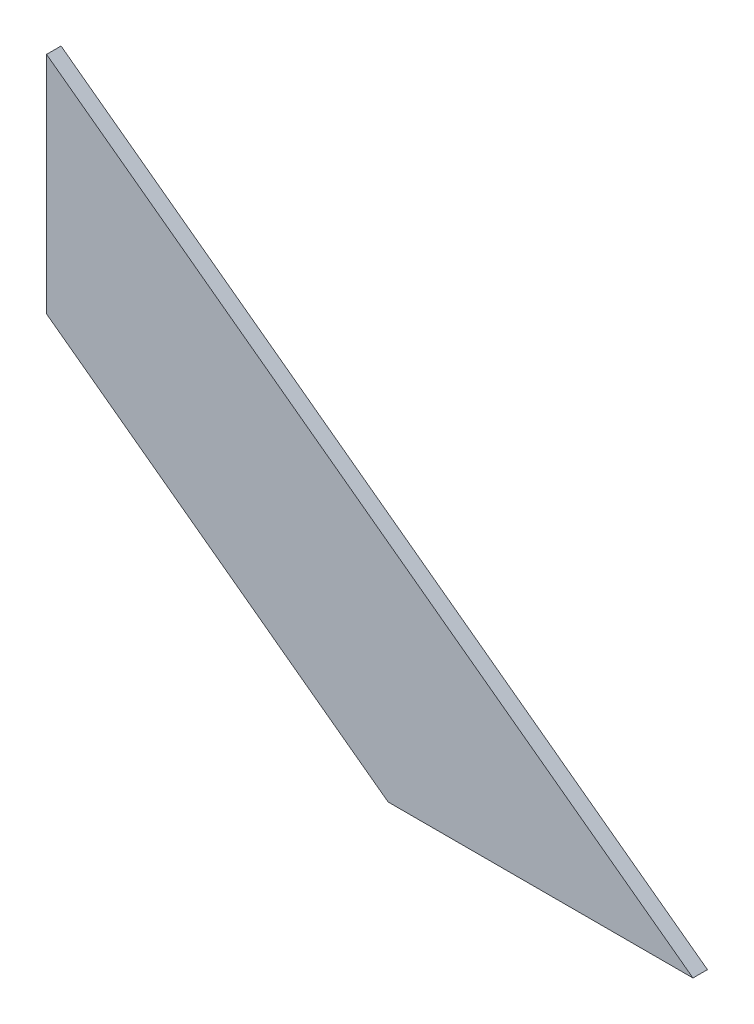
ISO-10303-21;
HEADER;
FILE_DESCRIPTION(('STEP AP214'),'2;1');
FILE_NAME('part.step','',(''),(''),'','','');
FILE_SCHEMA(('AUTOMOTIVE_DESIGN { 1 0 10303 214 1 1 1 1 }'));
ENDSEC;
DATA;
#1=APPLICATION_CONTEXT('core data for automotive mechanical design processes');
#2=APPLICATION_PROTOCOL_DEFINITION('international standard','automotive_design',2000,#1);
#3=PRODUCT_CONTEXT('',#1,'mechanical');
#4=PRODUCT('Part','Part','',(#3));
#5=PRODUCT_RELATED_PRODUCT_CATEGORY('part','',(#4));
#6=PRODUCT_DEFINITION_FORMATION('','',#4);
#7=PRODUCT_DEFINITION_CONTEXT('part definition',#1,'design');
#8=PRODUCT_DEFINITION('design','',#6,#7);
#9=PRODUCT_DEFINITION_SHAPE('','',#8);
#10=(LENGTH_UNIT() NAMED_UNIT(*) SI_UNIT(.MILLI.,.METRE.));
#11=(NAMED_UNIT(*) PLANE_ANGLE_UNIT() SI_UNIT($,.RADIAN.));
#12=(NAMED_UNIT(*) SI_UNIT($,.STERADIAN.) SOLID_ANGLE_UNIT());
#13=UNCERTAINTY_MEASURE_WITH_UNIT(LENGTH_MEASURE(1.E-05),#10,'distance_accuracy_value','');
#14=(GEOMETRIC_REPRESENTATION_CONTEXT(3) GLOBAL_UNCERTAINTY_ASSIGNED_CONTEXT((#13)) GLOBAL_UNIT_ASSIGNED_CONTEXT((#10,
#11,#12)) REPRESENTATION_CONTEXT('',''));
#15=CARTESIAN_POINT('',(0.,0.,0.));
#16=DIRECTION('',(0.,0.,1.));
#17=DIRECTION('',(1.,0.,0.));
#18=AXIS2_PLACEMENT_3D('',#15,#16,#17);
#19=CARTESIAN_POINT('',(-503.389866918467,-30.2616666212028,-1.524));
#20=DIRECTION('',(0.,1.,0.));
#21=DIRECTION('',(0.,0.,1.));
#22=AXIS2_PLACEMENT_3D('',#19,#20,#21);
#23=PLANE('',#22);
#24=DIRECTION('',(-1.,0.,0.));
#25=VECTOR('',#24,1.);
#26=CARTESIAN_POINT('',(-503.389866918467,-30.2616666212028,0.));
#27=LINE('',#26,#25);
#28=CARTESIAN_POINT('',(-471.292522592368,-30.2616666212028,0.));
#29=VERTEX_POINT('',#28);
#30=CARTESIAN_POINT('',(-503.389866918467,-30.2616666212028,0.));
#31=VERTEX_POINT('',#30);
#32=EDGE_CURVE('E96',#29,#31,#27,.T.);
#33=ORIENTED_EDGE('',*,*,#32,.T.);
#34=DIRECTION('',(0.,0.,1.));
#35=VECTOR('',#34,1.);
#36=CARTESIAN_POINT('',(-503.389866918467,-30.2616666212028,-1.524));
#37=LINE('',#36,#35);
#38=CARTESIAN_POINT('',(-503.389866918467,-30.2616666212028,-1.524));
#39=VERTEX_POINT('',#38);
#40=EDGE_CURVE('E11',#39,#31,#37,.T.);
#41=ORIENTED_EDGE('',*,*,#40,.F.);
#42=DIRECTION('',(-1.,0.,0.));
#43=VECTOR('',#42,1.);
#44=CARTESIAN_POINT('',(-503.389866918467,-30.2616666212028,-1.524));
#45=LINE('',#44,#43);
#46=CARTESIAN_POINT('',(-471.292522592368,-30.2616666212028,-1.524));
#47=VERTEX_POINT('',#46);
#48=EDGE_CURVE('E84',#47,#39,#45,.T.);
#49=ORIENTED_EDGE('',*,*,#48,.F.);
#50=DIRECTION('',(0.,0.,1.));
#51=VECTOR('',#50,1.);
#52=CARTESIAN_POINT('',(-471.292522592368,-30.2616666212028,-1.524));
#53=LINE('',#52,#51);
#54=EDGE_CURVE('E92',#47,#29,#53,.T.);
#55=ORIENTED_EDGE('',*,*,#54,.T.);
#56=EDGE_LOOP('',(#33,#41,#49,#55));
#57=FACE_BOUND('',#56,.T.);
#58=ADVANCED_FACE('F33',(#57),#23,.F.);
#59=CARTESIAN_POINT('',(-539.362495023416,-3.73427545755216,-1.524));
#60=DIRECTION('',(0.593507045519334,0.804828793544883,0.));
#61=DIRECTION('',(-0.804828793544883,0.593507045519334,0.));
#62=AXIS2_PLACEMENT_3D('',#59,#60,#61);
#63=PLANE('',#62);
#64=DIRECTION('',(-0.804828793544883,0.593507045519334,0.));
#65=VECTOR('',#64,1.);
#66=CARTESIAN_POINT('',(-539.362495023416,-3.73427545755216,0.));
#67=LINE('',#66,#65);
#68=CARTESIAN_POINT('',(-539.362495023416,-3.73427545755216,0.));
#69=VERTEX_POINT('',#68);
#70=EDGE_CURVE('E88',#31,#69,#67,.T.);
#71=ORIENTED_EDGE('',*,*,#70,.T.);
#72=DIRECTION('',(0.,0.,1.));
#73=VECTOR('',#72,1.);
#74=CARTESIAN_POINT('',(-539.362495023416,-3.73427545755216,-1.524));
#75=LINE('',#74,#73);
#76=CARTESIAN_POINT('',(-539.362495023416,-3.73427545755216,-1.524));
#77=VERTEX_POINT('',#76);
#78=EDGE_CURVE('E41',#77,#69,#75,.T.);
#79=ORIENTED_EDGE('',*,*,#78,.F.);
#80=DIRECTION('',(-0.804828793544883,0.593507045519334,0.));
#81=VECTOR('',#80,1.);
#82=CARTESIAN_POINT('',(-539.362495023416,-3.73427545755216,-1.524));
#83=LINE('',#82,#81);
#84=EDGE_CURVE('E79',#39,#77,#83,.T.);
#85=ORIENTED_EDGE('',*,*,#84,.F.);
#86=ORIENTED_EDGE('',*,*,#40,.T.);
#87=EDGE_LOOP('',(#71,#79,#85,#86));
#88=FACE_BOUND('',#87,.T.);
#89=ADVANCED_FACE('F87',(#88),#63,.F.);
#90=CARTESIAN_POINT('',(-539.362495023416,19.9353548449299,-1.524));
#91=DIRECTION('',(1.,0.,0.));
#92=DIRECTION('',(0.,0.,-1.));
#93=AXIS2_PLACEMENT_3D('',#90,#91,#92);
#94=PLANE('',#93);
#95=DIRECTION('',(0.,1.,0.));
#96=VECTOR('',#95,1.);
#97=CARTESIAN_POINT('',(-539.362495023416,19.9353548449299,0.));
#98=LINE('',#97,#96);
#99=CARTESIAN_POINT('',(-539.362495023416,19.9353548449299,0.));
#100=VERTEX_POINT('',#99);
#101=EDGE_CURVE('E66',#69,#100,#98,.T.);
#102=ORIENTED_EDGE('',*,*,#101,.T.);
#103=DIRECTION('',(0.,0.,1.));
#104=VECTOR('',#103,1.);
#105=CARTESIAN_POINT('',(-539.362495023416,19.9353548449299,-1.524));
#106=LINE('',#105,#104);
#107=CARTESIAN_POINT('',(-539.362495023416,19.9353548449299,-1.524));
#108=VERTEX_POINT('',#107);
#109=EDGE_CURVE('E89',#108,#100,#106,.T.);
#110=ORIENTED_EDGE('',*,*,#109,.F.);
#111=DIRECTION('',(0.,1.,0.));
#112=VECTOR('',#111,1.);
#113=CARTESIAN_POINT('',(-539.362495023416,19.9353548449299,-1.524));
#114=LINE('',#113,#112);
#115=EDGE_CURVE('E82',#77,#108,#114,.T.);
#116=ORIENTED_EDGE('',*,*,#115,.F.);
#117=ORIENTED_EDGE('',*,*,#78,.T.);
#118=EDGE_LOOP('',(#102,#110,#116,#117));
#119=FACE_BOUND('',#118,.T.);
#120=ADVANCED_FACE('F90',(#119),#94,.F.);
#121=CARTESIAN_POINT('',(-471.292522592368,-30.2616666212028,-1.524));
#122=DIRECTION('',(-0.593507045519334,-0.804828793544883,0.));
#123=DIRECTION('',(0.804828793544883,-0.593507045519334,0.));
#124=AXIS2_PLACEMENT_3D('',#121,#122,#123);
#125=PLANE('',#124);
#126=DIRECTION('',(0.804828793544883,-0.593507045519334,0.));
#127=VECTOR('',#126,1.);
#128=CARTESIAN_POINT('',(-471.292522592368,-30.2616666212028,0.));
#129=LINE('',#128,#127);
#130=EDGE_CURVE('E72',#100,#29,#129,.T.);
#131=ORIENTED_EDGE('',*,*,#130,.T.);
#132=ORIENTED_EDGE('',*,*,#54,.F.);
#133=DIRECTION('',(0.804828793544883,-0.593507045519334,0.));
#134=VECTOR('',#133,1.);
#135=CARTESIAN_POINT('',(-471.292522592368,-30.2616666212028,-1.524));
#136=LINE('',#135,#134);
#137=EDGE_CURVE('E49',#108,#47,#136,.T.);
#138=ORIENTED_EDGE('',*,*,#137,.F.);
#139=ORIENTED_EDGE('',*,*,#109,.T.);
#140=EDGE_LOOP('',(#131,#132,#138,#139));
#141=FACE_BOUND('',#140,.T.);
#142=ADVANCED_FACE('F103',(#141),#125,.F.);
#143=CARTESIAN_POINT('',(0.,0.,-1.524));
#144=DIRECTION('',(0.,0.,-1.));
#145=DIRECTION('',(-1.,0.,0.));
#146=AXIS2_PLACEMENT_3D('',#143,#144,#145);
#147=PLANE('',#146);
#148=ORIENTED_EDGE('',*,*,#48,.T.);
#149=ORIENTED_EDGE('',*,*,#84,.T.);
#150=ORIENTED_EDGE('',*,*,#115,.T.);
#151=ORIENTED_EDGE('',*,*,#137,.T.);
#152=EDGE_LOOP('',(#148,#149,#150,#151));
#153=FACE_BOUND('',#152,.T.);
#154=ADVANCED_FACE('F80',(#153),#147,.T.);
#155=CARTESIAN_POINT('',(0.,0.,0.));
#156=DIRECTION('',(0.,0.,-1.));
#157=DIRECTION('',(-1.,0.,0.));
#158=AXIS2_PLACEMENT_3D('',#155,#156,#157);
#159=PLANE('',#158);
#160=ORIENTED_EDGE('',*,*,#32,.F.);
#161=ORIENTED_EDGE('',*,*,#130,.F.);
#162=ORIENTED_EDGE('',*,*,#101,.F.);
#163=ORIENTED_EDGE('',*,*,#70,.F.);
#164=EDGE_LOOP('',(#160,#161,#162,#163));
#165=FACE_BOUND('',#164,.T.);
#166=ADVANCED_FACE('F106',(#165),#159,.F.);
#167=CLOSED_SHELL('',(#58,#89,#120,#142,#154,#166));
#168=MANIFOLD_SOLID_BREP('B2',#167);
#169=ADVANCED_BREP_SHAPE_REPRESENTATION('',(#18,#168),#14);
#170=SHAPE_DEFINITION_REPRESENTATION(#9,#169);
ENDSEC;
END-ISO-10303-21;
